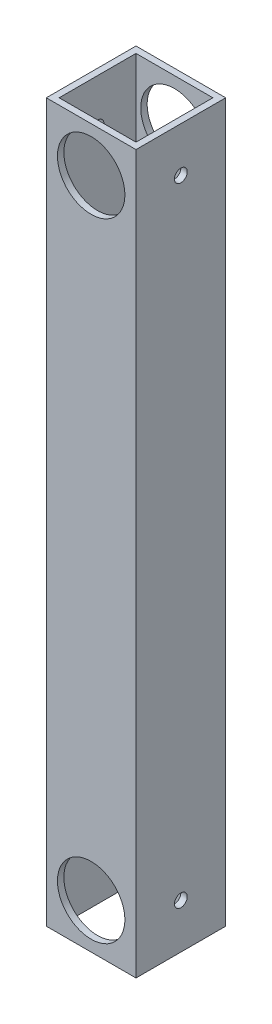
ISO-10303-21;
HEADER;
FILE_DESCRIPTION(('STEP AP214'),'2;1');
FILE_NAME('part.step','',(''),(''),'','','');
FILE_SCHEMA(('AUTOMOTIVE_DESIGN { 1 0 10303 214 1 1 1 1 }'));
ENDSEC;
DATA;
#1=APPLICATION_CONTEXT('core data for automotive mechanical design processes');
#2=APPLICATION_PROTOCOL_DEFINITION('international standard','automotive_design',2000,#1);
#3=PRODUCT_CONTEXT('',#1,'mechanical');
#4=PRODUCT('Part','Part','',(#3));
#5=PRODUCT_RELATED_PRODUCT_CATEGORY('part','',(#4));
#6=PRODUCT_DEFINITION_FORMATION('','',#4);
#7=PRODUCT_DEFINITION_CONTEXT('part definition',#1,'design');
#8=PRODUCT_DEFINITION('design','',#6,#7);
#9=PRODUCT_DEFINITION_SHAPE('','',#8);
#10=(LENGTH_UNIT() NAMED_UNIT(*) SI_UNIT(.MILLI.,.METRE.));
#11=(NAMED_UNIT(*) PLANE_ANGLE_UNIT() SI_UNIT($,.RADIAN.));
#12=(NAMED_UNIT(*) SI_UNIT($,.STERADIAN.) SOLID_ANGLE_UNIT());
#13=UNCERTAINTY_MEASURE_WITH_UNIT(LENGTH_MEASURE(1.E-05),#10,'distance_accuracy_value','');
#14=(GEOMETRIC_REPRESENTATION_CONTEXT(3) GLOBAL_UNCERTAINTY_ASSIGNED_CONTEXT((#13)) GLOBAL_UNIT_ASSIGNED_CONTEXT((#10,
#11,#12)) REPRESENTATION_CONTEXT('',''));
#15=CARTESIAN_POINT('',(0.,0.,0.));
#16=DIRECTION('',(0.,0.,1.));
#17=DIRECTION('',(1.,0.,0.));
#18=AXIS2_PLACEMENT_3D('',#15,#16,#17);
#19=CARTESIAN_POINT('',(-546.354000000005,311.150000000005,22.2249999999993));
#20=DIRECTION('',(1.,0.,0.));
#21=DIRECTION('',(0.,0.,-1.));
#22=AXIS2_PLACEMENT_3D('',#19,#20,#21);
#23=CYLINDRICAL_SURFACE('',#22,3.175);
#24=CARTESIAN_POINT('',(-565.150000000003,311.150000000005,22.2249999999989));
#25=DIRECTION('',(1.,0.,0.));
#26=DIRECTION('',(0.,0.,-1.));
#27=AXIS2_PLACEMENT_3D('',#24,#25,#26);
#28=CIRCLE('',#27,3.175);
#29=CARTESIAN_POINT('',(-565.150000000003,311.150000000005,19.0499999999989));
#30=VERTEX_POINT('',#29);
#31=EDGE_CURVE('E145',#30,#30,#28,.T.);
#32=ORIENTED_EDGE('',*,*,#31,.T.);
#33=EDGE_LOOP('',(#32));
#34=FACE_BOUND('',#33,.T.);
#35=CARTESIAN_POINT('',(-568.325000000005,311.150000000005,22.2249999999987));
#36=DIRECTION('',(1.,0.,0.));
#37=DIRECTION('',(0.,0.,-1.));
#38=AXIS2_PLACEMENT_3D('',#35,#36,#37);
#39=CIRCLE('',#38,3.175);
#40=CARTESIAN_POINT('',(-568.325000000005,311.150000000005,19.0499999999987));
#41=VERTEX_POINT('',#40);
#42=EDGE_CURVE('E17',#41,#41,#39,.T.);
#43=ORIENTED_EDGE('',*,*,#42,.F.);
#44=EDGE_LOOP('',(#43));
#45=FACE_BOUND('',#44,.T.);
#46=ADVANCED_FACE('F14',(#34,#45),#23,.F.);
#47=CARTESIAN_POINT('',(-546.354,4.13558076672871E-12,22.2249999999997));
#48=DIRECTION('',(1.,0.,0.));
#49=DIRECTION('',(0.,0.,-1.));
#50=AXIS2_PLACEMENT_3D('',#47,#48,#49);
#51=CYLINDRICAL_SURFACE('',#50,3.175);
#52=CARTESIAN_POINT('',(-565.15,4.66293670342566E-12,22.2249999999994));
#53=DIRECTION('',(1.,0.,0.));
#54=DIRECTION('',(0.,0.,-1.));
#55=AXIS2_PLACEMENT_3D('',#52,#53,#54);
#56=CIRCLE('',#55,3.175);
#57=CARTESIAN_POINT('',(-565.15,4.66634507047448E-12,19.0499999999994));
#58=VERTEX_POINT('',#57);
#59=EDGE_CURVE('E112',#58,#58,#56,.T.);
#60=ORIENTED_EDGE('',*,*,#59,.T.);
#61=EDGE_LOOP('',(#60));
#62=FACE_BOUND('',#61,.T.);
#63=CARTESIAN_POINT('',(-568.325,4.66293670342566E-12,22.2249999999994));
#64=DIRECTION('',(1.,0.,0.));
#65=DIRECTION('',(0.,0.,-1.));
#66=AXIS2_PLACEMENT_3D('',#63,#64,#65);
#67=CIRCLE('',#66,3.175);
#68=CARTESIAN_POINT('',(-568.325,4.66634507047448E-12,19.0499999999994));
#69=VERTEX_POINT('',#68);
#70=EDGE_CURVE('E118',#69,#69,#67,.T.);
#71=ORIENTED_EDGE('',*,*,#70,.F.);
#72=EDGE_LOOP('',(#71));
#73=FACE_BOUND('',#72,.T.);
#74=ADVANCED_FACE('F163',(#62,#73),#51,.F.);
#75=CARTESIAN_POINT('',(-587.375000000003,311.150000000005,-11.4300000000009));
#76=DIRECTION('',(0.,0.,-1.));
#77=DIRECTION('',(0.,1.,0.));
#78=AXIS2_PLACEMENT_3D('',#75,#76,#77);
#79=CYLINDRICAL_SURFACE('',#78,16.7005);
#80=CARTESIAN_POINT('',(-587.375000000003,311.150000000005,3.17499999999993));
#81=DIRECTION('',(0.,0.,-1.));
#82=DIRECTION('',(0.,1.,0.));
#83=AXIS2_PLACEMENT_3D('',#80,#81,#82);
#84=CIRCLE('',#83,16.7005);
#85=CARTESIAN_POINT('',(-587.375000000003,327.850500000005,3.17499999999991));
#86=VERTEX_POINT('',#85);
#87=EDGE_CURVE('E115',#86,#86,#84,.F.);
#88=ORIENTED_EDGE('',*,*,#87,.T.);
#89=EDGE_LOOP('',(#88));
#90=FACE_BOUND('',#89,.T.);
#91=CARTESIAN_POINT('',(-587.375000000003,311.150000000005,-6.66133814775094E-13));
#92=DIRECTION('',(0.,0.,-1.));
#93=DIRECTION('',(0.,1.,0.));
#94=AXIS2_PLACEMENT_3D('',#91,#92,#93);
#95=CIRCLE('',#94,16.7005);
#96=CARTESIAN_POINT('',(-587.375000000003,327.850500000005,-6.8610704683884E-13));
#97=VERTEX_POINT('',#96);
#98=EDGE_CURVE('E138',#97,#97,#95,.F.);
#99=ORIENTED_EDGE('',*,*,#98,.F.);
#100=EDGE_LOOP('',(#99));
#101=FACE_BOUND('',#100,.T.);
#102=ADVANCED_FACE('F165',(#90,#101),#79,.F.);
#103=CARTESIAN_POINT('',(-587.375,5.05151476204446E-12,12.7));
#104=DIRECTION('',(0.,0.,-1.));
#105=DIRECTION('',(-1.,0.,0.));
#106=AXIS2_PLACEMENT_3D('',#103,#104,#105);
#107=CYLINDRICAL_SURFACE('',#106,16.7005);
#108=CARTESIAN_POINT('',(-587.375,4.55191440096314E-12,0.));
#109=DIRECTION('',(0.,0.,-1.));
#110=DIRECTION('',(-1.,0.,0.));
#111=AXIS2_PLACEMENT_3D('',#108,#109,#110);
#112=CIRCLE('',#111,16.7005);
#113=CARTESIAN_POINT('',(-604.0755,4.68540578442881E-12,0.));
#114=VERTEX_POINT('',#113);
#115=EDGE_CURVE('E134',#114,#114,#112,.F.);
#116=ORIENTED_EDGE('',*,*,#115,.F.);
#117=EDGE_LOOP('',(#116));
#118=FACE_BOUND('',#117,.T.);
#119=CARTESIAN_POINT('',(-587.375000000002,4.55191440096314E-12,3.17500000000026));
#120=DIRECTION('',(0.,0.,-1.));
#121=DIRECTION('',(-1.,0.,0.));
#122=AXIS2_PLACEMENT_3D('',#119,#120,#121);
#123=CIRCLE('',#122,16.7005);
#124=CARTESIAN_POINT('',(-604.075500000002,4.68540578442881E-12,3.17500000000026));
#125=VERTEX_POINT('',#124);
#126=EDGE_CURVE('E114',#125,#125,#123,.F.);
#127=ORIENTED_EDGE('',*,*,#126,.T.);
#128=EDGE_LOOP('',(#127));
#129=FACE_BOUND('',#128,.T.);
#130=ADVANCED_FACE('F172',(#118,#129),#107,.F.);
#131=CARTESIAN_POINT('',(-609.6,333.375000000005,41.2749999999988));
#132=DIRECTION('',(0.,0.,-1.));
#133=DIRECTION('',(-1.,0.,0.));
#134=AXIS2_PLACEMENT_3D('',#131,#132,#133);
#135=PLANE('',#134);
#136=CARTESIAN_POINT('',(-587.375000000003,311.150000000005,41.2749999999993));
#137=DIRECTION('',(0.,0.,-1.));
#138=DIRECTION('',(-1.,0.,0.));
#139=AXIS2_PLACEMENT_3D('',#136,#137,#138);
#140=CIRCLE('',#139,16.7005);
#141=CARTESIAN_POINT('',(-604.075500000003,311.150000000005,41.2749999999993));
#142=VERTEX_POINT('',#141);
#143=EDGE_CURVE('E148',#142,#142,#140,.F.);
#144=ORIENTED_EDGE('',*,*,#143,.T.);
#145=EDGE_LOOP('',(#144));
#146=FACE_BOUND('',#145,.T.);
#147=CARTESIAN_POINT('',(-587.375000000002,4.38538094726937E-12,41.275));
#148=DIRECTION('',(0.,0.,-1.));
#149=DIRECTION('',(-1.,0.,0.));
#150=AXIS2_PLACEMENT_3D('',#147,#148,#149);
#151=CIRCLE('',#150,16.7005);
#152=CARTESIAN_POINT('',(-604.075500000002,4.51887233073504E-12,41.275));
#153=VERTEX_POINT('',#152);
#154=EDGE_CURVE('E151',#153,#153,#151,.F.);
#155=ORIENTED_EDGE('',*,*,#154,.T.);
#156=EDGE_LOOP('',(#155));
#157=FACE_BOUND('',#156,.T.);
#158=DIRECTION('',(1.,0.,0.));
#159=VECTOR('',#158,1.);
#160=CARTESIAN_POINT('',(-609.6,333.375000000005,41.2749999999988));
#161=LINE('',#160,#159);
#162=CARTESIAN_POINT('',(-606.425000000002,333.375000000005,41.2749999999988));
#163=VERTEX_POINT('',#162);
#164=CARTESIAN_POINT('',(-568.325000000003,333.375000000005,41.2749999999988));
#165=VERTEX_POINT('',#164);
#166=EDGE_CURVE('E104',#163,#165,#161,.T.);
#167=ORIENTED_EDGE('',*,*,#166,.T.);
#168=DIRECTION('',(0.,1.,0.));
#169=VECTOR('',#168,1.);
#170=CARTESIAN_POINT('',(-568.325000000003,333.375000000005,41.2749999999988));
#171=LINE('',#170,#169);
#172=CARTESIAN_POINT('',(-568.325000000002,-22.2249999999954,41.2749999999993));
#173=VERTEX_POINT('',#172);
#174=EDGE_CURVE('E116',#173,#165,#171,.T.);
#175=ORIENTED_EDGE('',*,*,#174,.F.);
#176=DIRECTION('',(1.,0.,0.));
#177=VECTOR('',#176,1.);
#178=CARTESIAN_POINT('',(-609.6,-22.224999999995,41.2749999999993));
#179=LINE('',#178,#177);
#180=CARTESIAN_POINT('',(-606.425,-22.2249999999953,41.2749999999993));
#181=VERTEX_POINT('',#180);
#182=EDGE_CURVE('E369',#181,#173,#179,.T.);
#183=ORIENTED_EDGE('',*,*,#182,.F.);
#184=DIRECTION('',(0.,1.,0.));
#185=VECTOR('',#184,1.);
#186=CARTESIAN_POINT('',(-606.425000000002,333.375000000005,41.2749999999988));
#187=LINE('',#186,#185);
#188=EDGE_CURVE('E100',#181,#163,#187,.T.);
#189=ORIENTED_EDGE('',*,*,#188,.T.);
#190=EDGE_LOOP('',(#167,#175,#183,#189));
#191=FACE_BOUND('',#190,.T.);
#192=ADVANCED_FACE('F226',(#146,#157,#191),#135,.T.);
#193=CARTESIAN_POINT('',(-568.325,333.375000000005,44.4499999999994));
#194=DIRECTION('',(-1.,0.,0.));
#195=DIRECTION('',(0.,0.,1.));
#196=AXIS2_PLACEMENT_3D('',#193,#194,#195);
#197=PLANE('',#196);
#198=ORIENTED_EDGE('',*,*,#70,.T.);
#199=EDGE_LOOP('',(#198));
#200=FACE_BOUND('',#199,.T.);
#201=DIRECTION('',(0.,0.,-1.));
#202=VECTOR('',#201,1.);
#203=CARTESIAN_POINT('',(-568.325000000002,333.375000000005,25.3999999999989));
#204=LINE('',#203,#202);
#205=CARTESIAN_POINT('',(-568.325000000003,333.375000000005,3.17499999999871));
#206=VERTEX_POINT('',#205);
#207=EDGE_CURVE('E106',#165,#206,#204,.T.);
#208=ORIENTED_EDGE('',*,*,#207,.T.);
#209=DIRECTION('',(0.,1.,0.));
#210=VECTOR('',#209,1.);
#211=CARTESIAN_POINT('',(-568.325000000003,333.375000000005,3.17499999999871));
#212=LINE('',#211,#210);
#213=CARTESIAN_POINT('',(-568.325000000002,-22.2249999999954,3.17499999999932));
#214=VERTEX_POINT('',#213);
#215=EDGE_CURVE('E76',#206,#214,#212,.F.);
#216=ORIENTED_EDGE('',*,*,#215,.T.);
#217=DIRECTION('',(0.,0.,-1.));
#218=VECTOR('',#217,1.);
#219=CARTESIAN_POINT('',(-568.325,-22.2249999999957,44.4499999999999));
#220=LINE('',#219,#218);
#221=EDGE_CURVE('E357',#173,#214,#220,.T.);
#222=ORIENTED_EDGE('',*,*,#221,.F.);
#223=ORIENTED_EDGE('',*,*,#174,.T.);
#224=EDGE_LOOP('',(#208,#216,#222,#223));
#225=FACE_BOUND('',#224,.T.);
#226=ORIENTED_EDGE('',*,*,#42,.T.);
#227=EDGE_LOOP('',(#226));
#228=FACE_BOUND('',#227,.T.);
#229=ADVANCED_FACE('F160',(#200,#225,#228),#197,.T.);
#230=CARTESIAN_POINT('',(-609.600000000003,333.375000000005,3.17499999999837));
#231=DIRECTION('',(0.,0.,-1.));
#232=DIRECTION('',(-1.,0.,0.));
#233=AXIS2_PLACEMENT_3D('',#230,#231,#232);
#234=PLANE('',#233);
#235=ORIENTED_EDGE('',*,*,#126,.F.);
#236=EDGE_LOOP('',(#235));
#237=FACE_BOUND('',#236,.T.);
#238=ORIENTED_EDGE('',*,*,#215,.F.);
#239=DIRECTION('',(1.,0.,0.));
#240=VECTOR('',#239,1.);
#241=CARTESIAN_POINT('',(-609.600000000003,333.375000000005,3.17499999999837));
#242=LINE('',#241,#240);
#243=CARTESIAN_POINT('',(-606.425000000003,333.375000000005,3.17499999999837));
#244=VERTEX_POINT('',#243);
#245=EDGE_CURVE('E79',#206,#244,#242,.F.);
#246=ORIENTED_EDGE('',*,*,#245,.T.);
#247=DIRECTION('',(0.,1.,0.));
#248=VECTOR('',#247,1.);
#249=CARTESIAN_POINT('',(-606.425000000003,333.375000000005,3.17499999999837));
#250=LINE('',#249,#248);
#251=CARTESIAN_POINT('',(-606.425000000002,-22.2249999999953,3.17499999999932));
#252=VERTEX_POINT('',#251);
#253=EDGE_CURVE('E83',#244,#252,#250,.F.);
#254=ORIENTED_EDGE('',*,*,#253,.T.);
#255=DIRECTION('',(1.,0.,0.));
#256=VECTOR('',#255,1.);
#257=CARTESIAN_POINT('',(-609.6,-22.224999999995,3.17499999999898));
#258=LINE('',#257,#256);
#259=EDGE_CURVE('E372',#214,#252,#258,.F.);
#260=ORIENTED_EDGE('',*,*,#259,.F.);
#261=EDGE_LOOP('',(#238,#246,#254,#260));
#262=FACE_BOUND('',#261,.T.);
#263=ORIENTED_EDGE('',*,*,#87,.F.);
#264=EDGE_LOOP('',(#263));
#265=FACE_BOUND('',#264,.T.);
#266=ADVANCED_FACE('F81',(#237,#262,#265),#234,.F.);
#267=CARTESIAN_POINT('',(-587.375,5.05151476204446E-12,12.7));
#268=DIRECTION('',(0.,0.,-1.));
#269=DIRECTION('',(-1.,0.,0.));
#270=AXIS2_PLACEMENT_3D('',#267,#268,#269);
#271=CYLINDRICAL_SURFACE('',#270,16.7005);
#272=ORIENTED_EDGE('',*,*,#154,.F.);
#273=EDGE_LOOP('',(#272));
#274=FACE_BOUND('',#273,.T.);
#275=CARTESIAN_POINT('',(-587.375,4.38538094726937E-12,44.45));
#276=DIRECTION('',(0.,0.,-1.));
#277=DIRECTION('',(-1.,0.,0.));
#278=AXIS2_PLACEMENT_3D('',#275,#276,#277);
#279=CIRCLE('',#278,16.7005);
#280=CARTESIAN_POINT('',(-604.0755,4.51887233073504E-12,44.45));
#281=VERTEX_POINT('',#280);
#282=EDGE_CURVE('E131',#281,#281,#279,.F.);
#283=ORIENTED_EDGE('',*,*,#282,.T.);
#284=EDGE_LOOP('',(#283));
#285=FACE_BOUND('',#284,.T.);
#286=ADVANCED_FACE('F216',(#274,#285),#271,.F.);
#287=CARTESIAN_POINT('',(-587.375000000003,311.150000000005,12.6999999999997));
#288=DIRECTION('',(0.,0.,-1.));
#289=DIRECTION('',(-1.,0.,0.));
#290=AXIS2_PLACEMENT_3D('',#287,#288,#289);
#291=CYLINDRICAL_SURFACE('',#290,16.7005);
#292=ORIENTED_EDGE('',*,*,#143,.F.);
#293=EDGE_LOOP('',(#292));
#294=FACE_BOUND('',#293,.T.);
#295=CARTESIAN_POINT('',(-587.375,311.150000000005,44.4499999999994));
#296=DIRECTION('',(0.,0.,-1.));
#297=DIRECTION('',(-1.,0.,0.));
#298=AXIS2_PLACEMENT_3D('',#295,#296,#297);
#299=CIRCLE('',#298,16.7005);
#300=CARTESIAN_POINT('',(-604.0755,311.150000000005,44.4499999999994));
#301=VERTEX_POINT('',#300);
#302=EDGE_CURVE('E128',#301,#301,#299,.F.);
#303=ORIENTED_EDGE('',*,*,#302,.T.);
#304=EDGE_LOOP('',(#303));
#305=FACE_BOUND('',#304,.T.);
#306=ADVANCED_FACE('F212',(#294,#305),#291,.F.);
#307=CARTESIAN_POINT('',(-565.149999999998,155.575000000004,22.2249999999995));
#308=DIRECTION('',(-1.,0.,0.));
#309=DIRECTION('',(0.,0.,1.));
#310=AXIS2_PLACEMENT_3D('',#307,#308,#309);
#311=PLANE('',#310);
#312=ORIENTED_EDGE('',*,*,#59,.F.);
#313=EDGE_LOOP('',(#312));
#314=FACE_BOUND('',#313,.T.);
#315=ORIENTED_EDGE('',*,*,#31,.F.);
#316=EDGE_LOOP('',(#315));
#317=FACE_BOUND('',#316,.T.);
#318=DIRECTION('',(0.,1.,0.));
#319=VECTOR('',#318,1.);
#320=CARTESIAN_POINT('',(-565.15,45.6223088562535,-1.33226762955019E-12));
#321=LINE('',#320,#319);
#322=CARTESIAN_POINT('',(-565.150000000003,333.375000000005,-1.60982338570648E-12));
#323=VERTEX_POINT('',#322);
#324=CARTESIAN_POINT('',(-565.15,-22.2249999999957,-3.88578058618805E-13));
#325=VERTEX_POINT('',#324);
#326=EDGE_CURVE('E137',#323,#325,#321,.F.);
#327=ORIENTED_EDGE('',*,*,#326,.F.);
#328=DIRECTION('',(0.,0.,-1.));
#329=VECTOR('',#328,1.);
#330=CARTESIAN_POINT('',(-565.150000000003,333.375000000005,25.3999999999989));
#331=LINE('',#330,#329);
#332=CARTESIAN_POINT('',(-565.15,333.375000000005,44.4499999999991));
#333=VERTEX_POINT('',#332);
#334=EDGE_CURVE('E89',#323,#333,#331,.F.);
#335=ORIENTED_EDGE('',*,*,#334,.T.);
#336=DIRECTION('',(0.,1.,0.));
#337=VECTOR('',#336,1.);
#338=CARTESIAN_POINT('',(-565.15,42.4473088562536,44.449999999999));
#339=LINE('',#338,#337);
#340=CARTESIAN_POINT('',(-565.15,-22.2249999999954,44.4499999999996));
#341=VERTEX_POINT('',#340);
#342=EDGE_CURVE('E127',#333,#341,#339,.F.);
#343=ORIENTED_EDGE('',*,*,#342,.T.);
#344=DIRECTION('',(0.,0.,-1.));
#345=VECTOR('',#344,1.);
#346=CARTESIAN_POINT('',(-565.15,-22.2249999999954,44.4499999999996));
#347=LINE('',#346,#345);
#348=EDGE_CURVE('E367',#325,#341,#347,.F.);
#349=ORIENTED_EDGE('',*,*,#348,.F.);
#350=EDGE_LOOP('',(#327,#335,#343,#349));
#351=FACE_BOUND('',#350,.T.);
#352=ADVANCED_FACE('F208',(#314,#317,#351),#311,.F.);
#353=CARTESIAN_POINT('',(-606.425,333.375000000005,44.4499999999991));
#354=DIRECTION('',(-1.,0.,0.));
#355=DIRECTION('',(0.,0.,1.));
#356=AXIS2_PLACEMENT_3D('',#353,#354,#355);
#357=PLANE('',#356);
#358=CARTESIAN_POINT('',(-606.425,4.82947015711943E-12,22.2249999999997));
#359=DIRECTION('',(1.,0.,0.));
#360=DIRECTION('',(0.,0.,-1.));
#361=AXIS2_PLACEMENT_3D('',#358,#359,#360);
#362=CIRCLE('',#361,3.175);
#363=CARTESIAN_POINT('',(-606.425,4.83287852416825E-12,19.0499999999996));
#364=VERTEX_POINT('',#363);
#365=EDGE_CURVE('E124',#364,#364,#362,.F.);
#366=ORIENTED_EDGE('',*,*,#365,.T.);
#367=EDGE_LOOP('',(#366));
#368=FACE_BOUND('',#367,.T.);
#369=CARTESIAN_POINT('',(-606.425000000005,311.150000000005,22.2249999999994));
#370=DIRECTION('',(1.,0.,0.));
#371=DIRECTION('',(0.,0.,-1.));
#372=AXIS2_PLACEMENT_3D('',#369,#370,#371);
#373=CIRCLE('',#372,3.175);
#374=CARTESIAN_POINT('',(-606.425000000005,311.150000000005,19.0499999999994));
#375=VERTEX_POINT('',#374);
#376=EDGE_CURVE('E99',#375,#375,#373,.F.);
#377=ORIENTED_EDGE('',*,*,#376,.T.);
#378=EDGE_LOOP('',(#377));
#379=FACE_BOUND('',#378,.T.);
#380=ORIENTED_EDGE('',*,*,#253,.F.);
#381=DIRECTION('',(0.,0.,-1.));
#382=VECTOR('',#381,1.);
#383=CARTESIAN_POINT('',(-606.425000000002,333.375000000005,25.3999999999989));
#384=LINE('',#383,#382);
#385=EDGE_CURVE('E88',#244,#163,#384,.F.);
#386=ORIENTED_EDGE('',*,*,#385,.T.);
#387=ORIENTED_EDGE('',*,*,#188,.F.);
#388=DIRECTION('',(0.,0.,-1.));
#389=VECTOR('',#388,1.);
#390=CARTESIAN_POINT('',(-606.425000000002,-22.2249999999954,44.4499999999998));
#391=LINE('',#390,#389);
#392=EDGE_CURVE('E97',#252,#181,#391,.F.);
#393=ORIENTED_EDGE('',*,*,#392,.F.);
#394=EDGE_LOOP('',(#380,#386,#387,#393));
#395=FACE_BOUND('',#394,.T.);
#396=ADVANCED_FACE('F93',(#368,#379,#395),#357,.F.);
#397=CARTESIAN_POINT('',(-546.354000000005,311.150000000005,22.2249999999993));
#398=DIRECTION('',(1.,0.,0.));
#399=DIRECTION('',(0.,0.,-1.));
#400=AXIS2_PLACEMENT_3D('',#397,#398,#399);
#401=CYLINDRICAL_SURFACE('',#400,3.175);
#402=ORIENTED_EDGE('',*,*,#376,.F.);
#403=EDGE_LOOP('',(#402));
#404=FACE_BOUND('',#403,.T.);
#405=CARTESIAN_POINT('',(-609.600000000006,311.150000000005,22.2249999999993));
#406=DIRECTION('',(1.,0.,0.));
#407=DIRECTION('',(0.,0.,-1.));
#408=AXIS2_PLACEMENT_3D('',#405,#406,#407);
#409=CIRCLE('',#408,3.175);
#410=CARTESIAN_POINT('',(-609.600000000006,311.150000000005,19.0499999999993));
#411=VERTEX_POINT('',#410);
#412=EDGE_CURVE('E120',#411,#411,#409,.T.);
#413=ORIENTED_EDGE('',*,*,#412,.F.);
#414=EDGE_LOOP('',(#413));
#415=FACE_BOUND('',#414,.T.);
#416=ADVANCED_FACE('F202',(#404,#415),#401,.F.);
#417=CARTESIAN_POINT('',(-609.600000000003,333.375000000005,25.3999999999989));
#418=DIRECTION('',(0.,-1.,0.));
#419=DIRECTION('',(0.,0.,-1.));
#420=AXIS2_PLACEMENT_3D('',#417,#418,#419);
#421=PLANE('',#420);
#422=ORIENTED_EDGE('',*,*,#166,.F.);
#423=ORIENTED_EDGE('',*,*,#385,.F.);
#424=ORIENTED_EDGE('',*,*,#245,.F.);
#425=ORIENTED_EDGE('',*,*,#207,.F.);
#426=EDGE_LOOP('',(#422,#423,#424,#425));
#427=FACE_BOUND('',#426,.T.);
#428=DIRECTION('',(0.,0.,1.));
#429=VECTOR('',#428,1.);
#430=CARTESIAN_POINT('',(-609.600000000006,333.375000000005,22.2249999999988));
#431=LINE('',#430,#429);
#432=CARTESIAN_POINT('',(-609.6,333.375000000005,44.4499999999991));
#433=VERTEX_POINT('',#432);
#434=CARTESIAN_POINT('',(-609.600000000005,333.375000000005,-1.49880108324396E-12));
#435=VERTEX_POINT('',#434);
#436=EDGE_CURVE('E123',#433,#435,#431,.F.);
#437=ORIENTED_EDGE('',*,*,#436,.F.);
#438=DIRECTION('',(1.,0.,0.));
#439=VECTOR('',#438,1.);
#440=CARTESIAN_POINT('',(-609.6,333.375000000005,44.4499999999991));
#441=LINE('',#440,#439);
#442=EDGE_CURVE('E376',#433,#333,#441,.T.);
#443=ORIENTED_EDGE('',*,*,#442,.T.);
#444=ORIENTED_EDGE('',*,*,#334,.F.);
#445=DIRECTION('',(-1.,0.,0.));
#446=VECTOR('',#445,1.);
#447=CARTESIAN_POINT('',(-609.600000000005,333.375000000005,-1.49880108324396E-12));
#448=LINE('',#447,#446);
#449=EDGE_CURVE('E361',#435,#323,#448,.F.);
#450=ORIENTED_EDGE('',*,*,#449,.F.);
#451=EDGE_LOOP('',(#437,#443,#444,#450));
#452=FACE_BOUND('',#451,.T.);
#453=ADVANCED_FACE('F102',(#427,#452),#421,.F.);
#454=CARTESIAN_POINT('',(-609.600000000005,45.6223088562536,-1.49880108324396E-12));
#455=DIRECTION('',(0.,0.,-1.));
#456=DIRECTION('',(-1.,0.,0.));
#457=AXIS2_PLACEMENT_3D('',#454,#455,#456);
#458=PLANE('',#457);
#459=DIRECTION('',(0.,1.,0.));
#460=VECTOR('',#459,1.);
#461=CARTESIAN_POINT('',(-609.600000000002,155.575000000005,-7.21644966006352E-13));
#462=LINE('',#461,#460);
#463=CARTESIAN_POINT('',(-609.600000000005,-22.224999999995,-7.7715611723761E-13));
#464=VERTEX_POINT('',#463);
#465=EDGE_CURVE('E383',#435,#464,#462,.F.);
#466=ORIENTED_EDGE('',*,*,#465,.F.);
#467=ORIENTED_EDGE('',*,*,#449,.T.);
#468=ORIENTED_EDGE('',*,*,#326,.T.);
#469=DIRECTION('',(1.,0.,0.));
#470=VECTOR('',#469,1.);
#471=CARTESIAN_POINT('',(-609.600000000005,-22.224999999995,-7.7715611723761E-13));
#472=LINE('',#471,#470);
#473=EDGE_CURVE('E364',#464,#325,#472,.T.);
#474=ORIENTED_EDGE('',*,*,#473,.F.);
#475=EDGE_LOOP('',(#466,#467,#468,#474));
#476=FACE_BOUND('',#475,.T.);
#477=ORIENTED_EDGE('',*,*,#115,.T.);
#478=EDGE_LOOP('',(#477));
#479=FACE_BOUND('',#478,.T.);
#480=ORIENTED_EDGE('',*,*,#98,.T.);
#481=EDGE_LOOP('',(#480));
#482=FACE_BOUND('',#481,.T.);
#483=ADVANCED_FACE('F195',(#476,#479,#482),#458,.T.);
#484=CARTESIAN_POINT('',(-609.6,-22.224999999995,44.4499999999993));
#485=DIRECTION('',(0.,-1.,0.));
#486=DIRECTION('',(0.,0.,-1.));
#487=AXIS2_PLACEMENT_3D('',#484,#485,#486);
#488=PLANE('',#487);
#489=ORIENTED_EDGE('',*,*,#259,.T.);
#490=ORIENTED_EDGE('',*,*,#392,.T.);
#491=ORIENTED_EDGE('',*,*,#182,.T.);
#492=ORIENTED_EDGE('',*,*,#221,.T.);
#493=EDGE_LOOP('',(#489,#490,#491,#492));
#494=FACE_BOUND('',#493,.T.);
#495=DIRECTION('',(1.,0.,0.));
#496=VECTOR('',#495,1.);
#497=CARTESIAN_POINT('',(-609.6,-22.224999999995,44.4499999999993));
#498=LINE('',#497,#496);
#499=CARTESIAN_POINT('',(-609.6,-22.224999999995,44.4499999999993));
#500=VERTEX_POINT('',#499);
#501=EDGE_CURVE('E32',#341,#500,#498,.F.);
#502=ORIENTED_EDGE('',*,*,#501,.T.);
#503=DIRECTION('',(0.,0.,1.));
#504=VECTOR('',#503,1.);
#505=CARTESIAN_POINT('',(-609.600000000003,-22.224999999995,22.2249999999995));
#506=LINE('',#505,#504);
#507=EDGE_CURVE('E386',#464,#500,#506,.T.);
#508=ORIENTED_EDGE('',*,*,#507,.F.);
#509=ORIENTED_EDGE('',*,*,#473,.T.);
#510=ORIENTED_EDGE('',*,*,#348,.T.);
#511=EDGE_LOOP('',(#502,#508,#509,#510));
#512=FACE_BOUND('',#511,.T.);
#513=ADVANCED_FACE('F191',(#494,#512),#488,.T.);
#514=CARTESIAN_POINT('',(-609.6,42.4473088562542,44.4499999999993));
#515=DIRECTION('',(0.,0.,-1.));
#516=DIRECTION('',(0.,1.,0.));
#517=AXIS2_PLACEMENT_3D('',#514,#515,#516);
#518=PLANE('',#517);
#519=ORIENTED_EDGE('',*,*,#442,.F.);
#520=DIRECTION('',(0.,1.,0.));
#521=VECTOR('',#520,1.);
#522=CARTESIAN_POINT('',(-609.6,155.575000000005,44.4499999999999));
#523=LINE('',#522,#521);
#524=EDGE_CURVE('E23',#500,#433,#523,.T.);
#525=ORIENTED_EDGE('',*,*,#524,.F.);
#526=ORIENTED_EDGE('',*,*,#501,.F.);
#527=ORIENTED_EDGE('',*,*,#342,.F.);
#528=EDGE_LOOP('',(#519,#525,#526,#527));
#529=FACE_BOUND('',#528,.T.);
#530=ORIENTED_EDGE('',*,*,#302,.F.);
#531=EDGE_LOOP('',(#530));
#532=FACE_BOUND('',#531,.T.);
#533=ORIENTED_EDGE('',*,*,#282,.F.);
#534=EDGE_LOOP('',(#533));
#535=FACE_BOUND('',#534,.T.);
#536=ADVANCED_FACE('F184',(#529,#532,#535),#518,.F.);
#537=CARTESIAN_POINT('',(-546.354,4.13558076672871E-12,22.2249999999997));
#538=DIRECTION('',(1.,0.,0.));
#539=DIRECTION('',(0.,0.,-1.));
#540=AXIS2_PLACEMENT_3D('',#537,#538,#539);
#541=CYLINDRICAL_SURFACE('',#540,3.175);
#542=ORIENTED_EDGE('',*,*,#365,.F.);
#543=EDGE_LOOP('',(#542));
#544=FACE_BOUND('',#543,.T.);
#545=CARTESIAN_POINT('',(-609.600000000003,5.13478148889135E-12,22.2249999999996));
#546=DIRECTION('',(1.,0.,0.));
#547=DIRECTION('',(0.,0.,-1.));
#548=AXIS2_PLACEMENT_3D('',#545,#546,#547);
#549=CIRCLE('',#548,3.175);
#550=CARTESIAN_POINT('',(-609.600000000003,5.13818985594017E-12,19.0499999999995));
#551=VERTEX_POINT('',#550);
#552=EDGE_CURVE('E9',#551,#551,#549,.T.);
#553=ORIENTED_EDGE('',*,*,#552,.F.);
#554=EDGE_LOOP('',(#553));
#555=FACE_BOUND('',#554,.T.);
#556=ADVANCED_FACE('F178',(#544,#555),#541,.F.);
#557=CARTESIAN_POINT('',(-609.600000000001,155.575000000005,22.2250000000002));
#558=DIRECTION('',(-1.,0.,0.));
#559=DIRECTION('',(0.,0.,1.));
#560=AXIS2_PLACEMENT_3D('',#557,#558,#559);
#561=PLANE('',#560);
#562=ORIENTED_EDGE('',*,*,#552,.T.);
#563=EDGE_LOOP('',(#562));
#564=FACE_BOUND('',#563,.T.);
#565=ORIENTED_EDGE('',*,*,#507,.T.);
#566=ORIENTED_EDGE('',*,*,#524,.T.);
#567=ORIENTED_EDGE('',*,*,#436,.T.);
#568=ORIENTED_EDGE('',*,*,#465,.T.);
#569=EDGE_LOOP('',(#565,#566,#567,#568));
#570=FACE_BOUND('',#569,.T.);
#571=ORIENTED_EDGE('',*,*,#412,.T.);
#572=EDGE_LOOP('',(#571));
#573=FACE_BOUND('',#572,.T.);
#574=ADVANCED_FACE('F176',(#564,#570,#573),#561,.T.);
#575=CLOSED_SHELL('',(#46,#74,#102,#130,#192,#229,#266,#286,#306,#352,#396,#416,#453,#483,#513,
#536,#556,#574));
#576=MANIFOLD_SOLID_BREP('B1',#575);
#577=ADVANCED_BREP_SHAPE_REPRESENTATION('',(#18,#576),#14);
#578=SHAPE_DEFINITION_REPRESENTATION(#9,#577);
ENDSEC;
END-ISO-10303-21;
